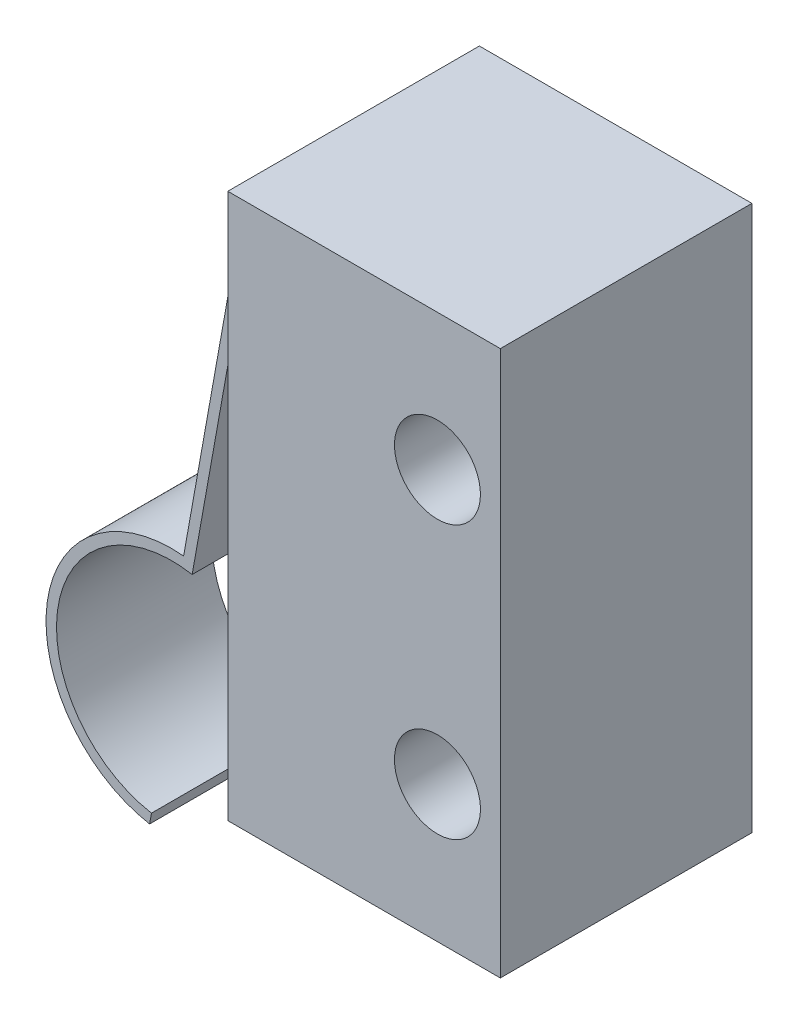
ISO-10303-21;
HEADER;
FILE_DESCRIPTION(('STEP AP214'),'2;1');
FILE_NAME('part.step','',(''),(''),'','','');
FILE_SCHEMA(('AUTOMOTIVE_DESIGN { 1 0 10303 214 1 1 1 1 }'));
ENDSEC;
DATA;
#1=APPLICATION_CONTEXT('core data for automotive mechanical design processes');
#2=APPLICATION_PROTOCOL_DEFINITION('international standard','automotive_design',2000,#1);
#3=PRODUCT_CONTEXT('',#1,'mechanical');
#4=PRODUCT('Part','Part','',(#3));
#5=PRODUCT_RELATED_PRODUCT_CATEGORY('part','',(#4));
#6=PRODUCT_DEFINITION_FORMATION('','',#4);
#7=PRODUCT_DEFINITION_CONTEXT('part definition',#1,'design');
#8=PRODUCT_DEFINITION('design','',#6,#7);
#9=PRODUCT_DEFINITION_SHAPE('','',#8);
#10=(LENGTH_UNIT() NAMED_UNIT(*) SI_UNIT(.MILLI.,.METRE.));
#11=(NAMED_UNIT(*) PLANE_ANGLE_UNIT() SI_UNIT($,.RADIAN.));
#12=(NAMED_UNIT(*) SI_UNIT($,.STERADIAN.) SOLID_ANGLE_UNIT());
#13=UNCERTAINTY_MEASURE_WITH_UNIT(LENGTH_MEASURE(1.E-05),#10,'distance_accuracy_value','');
#14=(GEOMETRIC_REPRESENTATION_CONTEXT(3) GLOBAL_UNCERTAINTY_ASSIGNED_CONTEXT((#13)) GLOBAL_UNIT_ASSIGNED_CONTEXT((#10,
#11,#12)) REPRESENTATION_CONTEXT('',''));
#15=CARTESIAN_POINT('',(0.,0.,0.));
#16=DIRECTION('',(0.,0.,1.));
#17=DIRECTION('',(1.,0.,0.));
#18=AXIS2_PLACEMENT_3D('',#15,#16,#17);
#19=CARTESIAN_POINT('',(3.25,6.5,3.));
#20=DIRECTION('',(-1.,0.,0.));
#21=DIRECTION('',(0.,-1.,0.));
#22=AXIS2_PLACEMENT_3D('',#19,#20,#21);
#23=PLANE('',#22);
#24=DIRECTION('',(0.,1.,0.));
#25=VECTOR('',#24,1.);
#26=CARTESIAN_POINT('',(3.25,6.5,-3.));
#27=LINE('',#26,#25);
#28=CARTESIAN_POINT('',(3.25,-6.5,-3.));
#29=VERTEX_POINT('',#28);
#30=CARTESIAN_POINT('',(3.25,6.5,-3.));
#31=VERTEX_POINT('',#30);
#32=EDGE_CURVE('E200',#29,#31,#27,.T.);
#33=ORIENTED_EDGE('',*,*,#32,.T.);
#34=DIRECTION('',(0.,0.,-1.));
#35=VECTOR('',#34,1.);
#36=CARTESIAN_POINT('',(3.25,6.5,3.));
#37=LINE('',#36,#35);
#38=CARTESIAN_POINT('',(3.25,6.5,3.));
#39=VERTEX_POINT('',#38);
#40=EDGE_CURVE('E11',#39,#31,#37,.T.);
#41=ORIENTED_EDGE('',*,*,#40,.F.);
#42=DIRECTION('',(0.,1.,0.));
#43=VECTOR('',#42,1.);
#44=CARTESIAN_POINT('',(3.25,6.5,3.));
#45=LINE('',#44,#43);
#46=CARTESIAN_POINT('',(3.25,-6.5,3.));
#47=VERTEX_POINT('',#46);
#48=EDGE_CURVE('E203',#47,#39,#45,.T.);
#49=ORIENTED_EDGE('',*,*,#48,.F.);
#50=DIRECTION('',(0.,0.,-1.));
#51=VECTOR('',#50,1.);
#52=CARTESIAN_POINT('',(3.25,-6.5,3.));
#53=LINE('',#52,#51);
#54=EDGE_CURVE('E213',#47,#29,#53,.T.);
#55=ORIENTED_EDGE('',*,*,#54,.T.);
#56=EDGE_LOOP('',(#33,#41,#49,#55));
#57=FACE_BOUND('',#56,.T.);
#58=ADVANCED_FACE('F33',(#57),#23,.F.);
#59=CARTESIAN_POINT('',(-3.25,6.5,3.));
#60=DIRECTION('',(0.,-1.,0.));
#61=DIRECTION('',(0.,0.,-1.));
#62=AXIS2_PLACEMENT_3D('',#59,#60,#61);
#63=PLANE('',#62);
#64=DIRECTION('',(-1.,0.,0.));
#65=VECTOR('',#64,1.);
#66=CARTESIAN_POINT('',(-3.25,6.5,-3.));
#67=LINE('',#66,#65);
#68=CARTESIAN_POINT('',(-3.25,6.5,-3.));
#69=VERTEX_POINT('',#68);
#70=EDGE_CURVE('E216',#31,#69,#67,.T.);
#71=ORIENTED_EDGE('',*,*,#70,.T.);
#72=DIRECTION('',(0.,0.,-1.));
#73=VECTOR('',#72,1.);
#74=CARTESIAN_POINT('',(-3.25,6.5,3.));
#75=LINE('',#74,#73);
#76=CARTESIAN_POINT('',(-3.25,6.5,3.));
#77=VERTEX_POINT('',#76);
#78=EDGE_CURVE('E40',#77,#69,#75,.T.);
#79=ORIENTED_EDGE('',*,*,#78,.F.);
#80=DIRECTION('',(-1.,0.,0.));
#81=VECTOR('',#80,1.);
#82=CARTESIAN_POINT('',(-3.25,6.5,3.));
#83=LINE('',#82,#81);
#84=EDGE_CURVE('E206',#39,#77,#83,.T.);
#85=ORIENTED_EDGE('',*,*,#84,.F.);
#86=ORIENTED_EDGE('',*,*,#40,.T.);
#87=EDGE_LOOP('',(#71,#79,#85,#86));
#88=FACE_BOUND('',#87,.T.);
#89=ADVANCED_FACE('F246',(#88),#63,.F.);
#90=CARTESIAN_POINT('',(-3.25,6.5,3.));
#91=DIRECTION('',(1.,0.,0.));
#92=DIRECTION('',(0.,0.,-1.));
#93=AXIS2_PLACEMENT_3D('',#90,#91,#92);
#94=PLANE('',#93);
#95=DIRECTION('',(0.,0.,-1.));
#96=VECTOR('',#95,1.);
#97=CARTESIAN_POINT('',(-3.25,5.625,1.85));
#98=LINE('',#97,#96);
#99=CARTESIAN_POINT('',(-3.25,5.625,1.85));
#100=VERTEX_POINT('',#99);
#101=CARTESIAN_POINT('',(-3.25,5.625,-1.85));
#102=VERTEX_POINT('',#101);
#103=EDGE_CURVE('E52',#100,#102,#98,.T.);
#104=ORIENTED_EDGE('',*,*,#103,.F.);
#105=DIRECTION('',(0.,-1.,0.));
#106=VECTOR('',#105,1.);
#107=CARTESIAN_POINT('',(-3.25,5.625,1.85));
#108=LINE('',#107,#106);
#109=CARTESIAN_POINT('',(-3.25,5.375,1.85));
#110=VERTEX_POINT('',#109);
#111=EDGE_CURVE('E47',#100,#110,#108,.T.);
#112=ORIENTED_EDGE('',*,*,#111,.T.);
#113=DIRECTION('',(0.,0.,-1.));
#114=VECTOR('',#113,1.);
#115=CARTESIAN_POINT('',(-3.25,5.375,1.85));
#116=LINE('',#115,#114);
#117=CARTESIAN_POINT('',(-3.25,5.375,-1.85));
#118=VERTEX_POINT('',#117);
#119=EDGE_CURVE('E184',#110,#118,#116,.T.);
#120=ORIENTED_EDGE('',*,*,#119,.T.);
#121=DIRECTION('',(0.,-1.,0.));
#122=VECTOR('',#121,1.);
#123=CARTESIAN_POINT('',(-3.25,5.625,-1.85));
#124=LINE('',#123,#122);
#125=EDGE_CURVE('E173',#102,#118,#124,.T.);
#126=ORIENTED_EDGE('',*,*,#125,.F.);
#127=EDGE_LOOP('',(#104,#112,#120,#126));
#128=FACE_BOUND('',#127,.T.);
#129=DIRECTION('',(0.,-1.,0.));
#130=VECTOR('',#129,1.);
#131=CARTESIAN_POINT('',(-3.25,6.5,-3.));
#132=LINE('',#131,#130);
#133=CARTESIAN_POINT('',(-3.25,-6.5,-3.));
#134=VERTEX_POINT('',#133);
#135=EDGE_CURVE('E218',#69,#134,#132,.T.);
#136=ORIENTED_EDGE('',*,*,#135,.T.);
#137=DIRECTION('',(0.,0.,-1.));
#138=VECTOR('',#137,1.);
#139=CARTESIAN_POINT('',(-3.25,-6.5,3.));
#140=LINE('',#139,#138);
#141=CARTESIAN_POINT('',(-3.25,-6.5,3.));
#142=VERTEX_POINT('',#141);
#143=EDGE_CURVE('E223',#142,#134,#140,.T.);
#144=ORIENTED_EDGE('',*,*,#143,.F.);
#145=DIRECTION('',(0.,-1.,0.));
#146=VECTOR('',#145,1.);
#147=CARTESIAN_POINT('',(-3.25,6.5,3.));
#148=LINE('',#147,#146);
#149=EDGE_CURVE('E209',#77,#142,#148,.T.);
#150=ORIENTED_EDGE('',*,*,#149,.F.);
#151=ORIENTED_EDGE('',*,*,#78,.T.);
#152=EDGE_LOOP('',(#136,#144,#150,#151));
#153=FACE_BOUND('',#152,.T.);
#154=ADVANCED_FACE('F230',(#128,#153),#94,.F.);
#155=CARTESIAN_POINT('',(-3.25,-6.5,3.));
#156=DIRECTION('',(0.,1.,0.));
#157=DIRECTION('',(0.,0.,1.));
#158=AXIS2_PLACEMENT_3D('',#155,#156,#157);
#159=PLANE('',#158);
#160=DIRECTION('',(1.,0.,0.));
#161=VECTOR('',#160,1.);
#162=CARTESIAN_POINT('',(-3.25,-6.5,-3.));
#163=LINE('',#162,#161);
#164=EDGE_CURVE('E207',#134,#29,#163,.T.);
#165=ORIENTED_EDGE('',*,*,#164,.T.);
#166=ORIENTED_EDGE('',*,*,#54,.F.);
#167=DIRECTION('',(1.,0.,0.));
#168=VECTOR('',#167,1.);
#169=CARTESIAN_POINT('',(-3.25,-6.5,3.));
#170=LINE('',#169,#168);
#171=EDGE_CURVE('E211',#142,#47,#170,.T.);
#172=ORIENTED_EDGE('',*,*,#171,.F.);
#173=ORIENTED_EDGE('',*,*,#143,.T.);
#174=EDGE_LOOP('',(#165,#166,#172,#173));
#175=FACE_BOUND('',#174,.T.);
#176=ADVANCED_FACE('F239',(#175),#159,.F.);
#177=CARTESIAN_POINT('',(0.,0.,3.));
#178=DIRECTION('',(0.,0.,1.));
#179=DIRECTION('',(1.,0.,0.));
#180=AXIS2_PLACEMENT_3D('',#177,#178,#179);
#181=PLANE('',#180);
#182=CARTESIAN_POINT('',(1.74999999999999,-3.25,3.));
#183=DIRECTION('',(0.,0.,1.));
#184=DIRECTION('',(-1.,0.,0.));
#185=AXIS2_PLACEMENT_3D('',#182,#183,#184);
#186=CIRCLE('',#185,1.025);
#187=CARTESIAN_POINT('',(0.724999999999993,-3.25,3.));
#188=VERTEX_POINT('',#187);
#189=EDGE_CURVE('E142',#188,#188,#186,.T.);
#190=ORIENTED_EDGE('',*,*,#189,.F.);
#191=EDGE_LOOP('',(#190));
#192=FACE_BOUND('',#191,.T.);
#193=CARTESIAN_POINT('',(1.74999999999999,3.25,3.));
#194=DIRECTION('',(0.,0.,1.));
#195=DIRECTION('',(1.,0.,0.));
#196=AXIS2_PLACEMENT_3D('',#193,#194,#195);
#197=CIRCLE('',#196,1.025);
#198=CARTESIAN_POINT('',(2.77499999999999,3.25,3.));
#199=VERTEX_POINT('',#198);
#200=EDGE_CURVE('E194',#199,#199,#197,.T.);
#201=ORIENTED_EDGE('',*,*,#200,.F.);
#202=EDGE_LOOP('',(#201));
#203=FACE_BOUND('',#202,.T.);
#204=ORIENTED_EDGE('',*,*,#48,.T.);
#205=ORIENTED_EDGE('',*,*,#84,.T.);
#206=ORIENTED_EDGE('',*,*,#149,.T.);
#207=ORIENTED_EDGE('',*,*,#171,.T.);
#208=EDGE_LOOP('',(#204,#205,#206,#207));
#209=FACE_BOUND('',#208,.T.);
#210=ADVANCED_FACE('F245',(#192,#203,#209),#181,.T.);
#211=CARTESIAN_POINT('',(0.,0.,-3.));
#212=DIRECTION('',(0.,0.,1.));
#213=DIRECTION('',(1.,0.,0.));
#214=AXIS2_PLACEMENT_3D('',#211,#212,#213);
#215=PLANE('',#214);
#216=CARTESIAN_POINT('',(1.74999999999999,-3.25,-3.));
#217=DIRECTION('',(0.,0.,1.));
#218=DIRECTION('',(-1.,0.,0.));
#219=AXIS2_PLACEMENT_3D('',#216,#217,#218);
#220=CIRCLE('',#219,1.025);
#221=CARTESIAN_POINT('',(0.724999999999993,-3.25,-3.));
#222=VERTEX_POINT('',#221);
#223=EDGE_CURVE('E191',#222,#222,#220,.T.);
#224=ORIENTED_EDGE('',*,*,#223,.T.);
#225=EDGE_LOOP('',(#224));
#226=FACE_BOUND('',#225,.T.);
#227=CARTESIAN_POINT('',(1.74999999999999,3.25,-3.));
#228=DIRECTION('',(0.,0.,1.));
#229=DIRECTION('',(1.,0.,0.));
#230=AXIS2_PLACEMENT_3D('',#227,#228,#229);
#231=CIRCLE('',#230,1.025);
#232=CARTESIAN_POINT('',(2.77499999999999,3.25,-3.));
#233=VERTEX_POINT('',#232);
#234=EDGE_CURVE('E197',#233,#233,#231,.T.);
#235=ORIENTED_EDGE('',*,*,#234,.T.);
#236=EDGE_LOOP('',(#235));
#237=FACE_BOUND('',#236,.T.);
#238=ORIENTED_EDGE('',*,*,#32,.F.);
#239=ORIENTED_EDGE('',*,*,#164,.F.);
#240=ORIENTED_EDGE('',*,*,#135,.F.);
#241=ORIENTED_EDGE('',*,*,#70,.F.);
#242=EDGE_LOOP('',(#238,#239,#240,#241));
#243=FACE_BOUND('',#242,.T.);
#244=ADVANCED_FACE('F236',(#226,#237,#243),#215,.F.);
#245=CARTESIAN_POINT('',(1.74999999999999,3.25,-3.));
#246=DIRECTION('',(0.,0.,1.));
#247=DIRECTION('',(1.,0.,0.));
#248=AXIS2_PLACEMENT_3D('',#245,#246,#247);
#249=CYLINDRICAL_SURFACE('',#248,1.025);
#250=ORIENTED_EDGE('',*,*,#234,.F.);
#251=EDGE_LOOP('',(#250));
#252=FACE_BOUND('',#251,.T.);
#253=ORIENTED_EDGE('',*,*,#200,.T.);
#254=EDGE_LOOP('',(#253));
#255=FACE_BOUND('',#254,.T.);
#256=ADVANCED_FACE('F258',(#252,#255),#249,.F.);
#257=CARTESIAN_POINT('',(1.74999999999999,-3.25,-3.));
#258=DIRECTION('',(0.,0.,1.));
#259=DIRECTION('',(1.,0.,0.));
#260=AXIS2_PLACEMENT_3D('',#257,#258,#259);
#261=CYLINDRICAL_SURFACE('',#260,1.025);
#262=ORIENTED_EDGE('',*,*,#223,.F.);
#263=EDGE_LOOP('',(#262));
#264=FACE_BOUND('',#263,.T.);
#265=ORIENTED_EDGE('',*,*,#189,.T.);
#266=EDGE_LOOP('',(#265));
#267=FACE_BOUND('',#266,.T.);
#268=ADVANCED_FACE('F265',(#264,#267),#261,.F.);
#269=CARTESIAN_POINT('',(-5.73529411764706,-5.69844152765688,1.85));
#270=DIRECTION('',(0.,0.,-1.));
#271=DIRECTION('',(-1.,0.,0.));
#272=AXIS2_PLACEMENT_3D('',#269,#270,#271);
#273=CYLINDRICAL_SURFACE('',#272,3.);
#274=CARTESIAN_POINT('',(-5.73529411764706,-5.69844152765688,-1.85));
#275=DIRECTION('',(0.,0.,1.));
#276=DIRECTION('',(1.,0.,0.));
#277=AXIS2_PLACEMENT_3D('',#274,#275,#276);
#278=CIRCLE('',#277,3.);
#279=CARTESIAN_POINT('',(-5.4538002691379,-2.71167718923788,-1.85));
#280=VERTEX_POINT('',#279);
#281=CARTESIAN_POINT('',(-6.26470588235294,-8.65135926836538,-1.85));
#282=VERTEX_POINT('',#281);
#283=EDGE_CURVE('E138',#280,#282,#278,.T.);
#284=ORIENTED_EDGE('',*,*,#283,.T.);
#285=DIRECTION('',(0.,0.,-1.));
#286=VECTOR('',#285,1.);
#287=CARTESIAN_POINT('',(-6.26470588235294,-8.65135926836538,1.85));
#288=LINE('',#287,#286);
#289=CARTESIAN_POINT('',(-6.26470588235294,-8.65135926836538,1.85));
#290=VERTEX_POINT('',#289);
#291=EDGE_CURVE('E135',#290,#282,#288,.T.);
#292=ORIENTED_EDGE('',*,*,#291,.F.);
#293=CARTESIAN_POINT('',(-5.73529411764706,-5.69844152765688,1.85));
#294=DIRECTION('',(0.,0.,1.));
#295=DIRECTION('',(1.,0.,0.));
#296=AXIS2_PLACEMENT_3D('',#293,#294,#295);
#297=CIRCLE('',#296,3.);
#298=CARTESIAN_POINT('',(-5.4538002691379,-2.71167718923788,1.85));
#299=VERTEX_POINT('',#298);
#300=EDGE_CURVE('E120',#299,#290,#297,.T.);
#301=ORIENTED_EDGE('',*,*,#300,.F.);
#302=DIRECTION('',(0.,0.,-1.));
#303=VECTOR('',#302,1.);
#304=CARTESIAN_POINT('',(-5.4538002691379,-2.71167718923788,1.85));
#305=LINE('',#304,#303);
#306=EDGE_CURVE('E160',#299,#280,#305,.T.);
#307=ORIENTED_EDGE('',*,*,#306,.T.);
#308=EDGE_LOOP('',(#284,#292,#301,#307));
#309=FACE_BOUND('',#308,.T.);
#310=ADVANCED_FACE('F136',(#309),#273,.T.);
#311=CARTESIAN_POINT('',(-6.22058823529412,-8.40528278997301,1.85));
#312=DIRECTION('',(0.9843059135695,-0.176470588235295,0.));
#313=DIRECTION('',(0.176470588235295,0.984305913569501,0.));
#314=AXIS2_PLACEMENT_3D('',#311,#312,#313);
#315=PLANE('',#314);
#316=DIRECTION('',(-0.176470588235295,-0.9843059135695,0.));
#317=VECTOR('',#316,1.);
#318=CARTESIAN_POINT('',(-6.22058823529412,-8.40528278997301,-1.85));
#319=LINE('',#318,#317);
#320=CARTESIAN_POINT('',(-6.22058823529412,-8.40528278997301,-1.85));
#321=VERTEX_POINT('',#320);
#322=EDGE_CURVE('E162',#321,#282,#319,.T.);
#323=ORIENTED_EDGE('',*,*,#322,.F.);
#324=DIRECTION('',(0.,0.,-1.));
#325=VECTOR('',#324,1.);
#326=CARTESIAN_POINT('',(-6.22058823529412,-8.40528278997301,1.85));
#327=LINE('',#326,#325);
#328=CARTESIAN_POINT('',(-6.22058823529412,-8.40528278997301,1.85));
#329=VERTEX_POINT('',#328);
#330=EDGE_CURVE('E143',#329,#321,#327,.T.);
#331=ORIENTED_EDGE('',*,*,#330,.F.);
#332=DIRECTION('',(-0.176470588235295,-0.9843059135695,0.));
#333=VECTOR('',#332,1.);
#334=CARTESIAN_POINT('',(-6.22058823529412,-8.40528278997301,1.85));
#335=LINE('',#334,#333);
#336=EDGE_CURVE('E125',#329,#290,#335,.T.);
#337=ORIENTED_EDGE('',*,*,#336,.T.);
#338=ORIENTED_EDGE('',*,*,#291,.T.);
#339=EDGE_LOOP('',(#323,#331,#337,#338));
#340=FACE_BOUND('',#339,.T.);
#341=ADVANCED_FACE('F145',(#340),#315,.T.);
#342=CARTESIAN_POINT('',(-5.73529411764706,-5.69844152765688,1.85));
#343=DIRECTION('',(0.,0.,-1.));
#344=DIRECTION('',(-1.,0.,0.));
#345=AXIS2_PLACEMENT_3D('',#342,#343,#344);
#346=CYLINDRICAL_SURFACE('',#345,2.75);
#347=CARTESIAN_POINT('',(-5.73529411764706,-5.69844152765688,-1.85));
#348=DIRECTION('',(0.,0.,1.));
#349=DIRECTION('',(1.,0.,0.));
#350=AXIS2_PLACEMENT_3D('',#347,#348,#349);
#351=CIRCLE('',#350,2.75);
#352=CARTESIAN_POINT('',(-5.25,-2.99160026534076,-1.85));
#353=VERTEX_POINT('',#352);
#354=EDGE_CURVE('E164',#353,#321,#351,.T.);
#355=ORIENTED_EDGE('',*,*,#354,.F.);
#356=DIRECTION('',(0.,0.,-1.));
#357=VECTOR('',#356,1.);
#358=CARTESIAN_POINT('',(-5.25,-2.99160026534076,1.85));
#359=LINE('',#358,#357);
#360=CARTESIAN_POINT('',(-5.25,-2.99160026534076,1.85));
#361=VERTEX_POINT('',#360);
#362=EDGE_CURVE('E188',#361,#353,#359,.T.);
#363=ORIENTED_EDGE('',*,*,#362,.F.);
#364=CARTESIAN_POINT('',(-5.73529411764706,-5.69844152765688,1.85));
#365=DIRECTION('',(0.,0.,1.));
#366=DIRECTION('',(1.,0.,0.));
#367=AXIS2_PLACEMENT_3D('',#364,#365,#366);
#368=CIRCLE('',#367,2.75);
#369=EDGE_CURVE('E146',#361,#329,#368,.T.);
#370=ORIENTED_EDGE('',*,*,#369,.T.);
#371=ORIENTED_EDGE('',*,*,#330,.T.);
#372=EDGE_LOOP('',(#355,#363,#370,#371));
#373=FACE_BOUND('',#372,.T.);
#374=ADVANCED_FACE('F274',(#373),#346,.F.);
#375=CARTESIAN_POINT('',(-3.75,5.375,1.85));
#376=DIRECTION('',(0.984305913569501,-0.176470588235294,0.));
#377=DIRECTION('',(0.176470588235294,0.984305913569501,0.));
#378=AXIS2_PLACEMENT_3D('',#375,#376,#377);
#379=PLANE('',#378);
#380=DIRECTION('',(-0.176470588235294,-0.984305913569501,0.));
#381=VECTOR('',#380,1.);
#382=CARTESIAN_POINT('',(-3.75,5.375,-1.85));
#383=LINE('',#382,#381);
#384=CARTESIAN_POINT('',(-3.75,5.375,-1.85));
#385=VERTEX_POINT('',#384);
#386=EDGE_CURVE('E167',#385,#353,#383,.T.);
#387=ORIENTED_EDGE('',*,*,#386,.F.);
#388=DIRECTION('',(0.,0.,-1.));
#389=VECTOR('',#388,1.);
#390=CARTESIAN_POINT('',(-3.75,5.375,1.85));
#391=LINE('',#390,#389);
#392=CARTESIAN_POINT('',(-3.75,5.375,1.85));
#393=VERTEX_POINT('',#392);
#394=EDGE_CURVE('E186',#393,#385,#391,.T.);
#395=ORIENTED_EDGE('',*,*,#394,.F.);
#396=DIRECTION('',(-0.176470588235294,-0.984305913569501,0.));
#397=VECTOR('',#396,1.);
#398=CARTESIAN_POINT('',(-3.75,5.375,1.85));
#399=LINE('',#398,#397);
#400=EDGE_CURVE('E148',#393,#361,#399,.T.);
#401=ORIENTED_EDGE('',*,*,#400,.T.);
#402=ORIENTED_EDGE('',*,*,#362,.T.);
#403=EDGE_LOOP('',(#387,#395,#401,#402));
#404=FACE_BOUND('',#403,.T.);
#405=ADVANCED_FACE('F277',(#404),#379,.T.);
#406=CARTESIAN_POINT('',(-3.25,5.375,1.85));
#407=DIRECTION('',(0.,-1.,0.));
#408=DIRECTION('',(0.,0.,-1.));
#409=AXIS2_PLACEMENT_3D('',#406,#407,#408);
#410=PLANE('',#409);
#411=DIRECTION('',(-1.,0.,0.));
#412=VECTOR('',#411,1.);
#413=CARTESIAN_POINT('',(-3.25,5.375,-1.85));
#414=LINE('',#413,#412);
#415=EDGE_CURVE('E170',#118,#385,#414,.T.);
#416=ORIENTED_EDGE('',*,*,#415,.F.);
#417=ORIENTED_EDGE('',*,*,#119,.F.);
#418=DIRECTION('',(-1.,0.,0.));
#419=VECTOR('',#418,1.);
#420=CARTESIAN_POINT('',(-3.25,5.375,1.85));
#421=LINE('',#420,#419);
#422=EDGE_CURVE('E153',#110,#393,#421,.T.);
#423=ORIENTED_EDGE('',*,*,#422,.T.);
#424=ORIENTED_EDGE('',*,*,#394,.T.);
#425=EDGE_LOOP('',(#416,#417,#423,#424));
#426=FACE_BOUND('',#425,.T.);
#427=ADVANCED_FACE('F281',(#426),#410,.T.);
#428=CARTESIAN_POINT('',(-3.25,5.625,1.85));
#429=DIRECTION('',(0.,-1.,0.));
#430=DIRECTION('',(0.,0.,-1.));
#431=AXIS2_PLACEMENT_3D('',#428,#429,#430);
#432=PLANE('',#431);
#433=DIRECTION('',(1.,0.,0.));
#434=VECTOR('',#433,1.);
#435=CARTESIAN_POINT('',(-3.25,5.625,-1.85));
#436=LINE('',#435,#434);
#437=CARTESIAN_POINT('',(-3.95916500663352,5.625,-1.85));
#438=VERTEX_POINT('',#437);
#439=EDGE_CURVE('E176',#102,#438,#436,.F.);
#440=ORIENTED_EDGE('',*,*,#439,.T.);
#441=DIRECTION('',(0.,0.,-1.));
#442=VECTOR('',#441,1.);
#443=CARTESIAN_POINT('',(-3.95916500663352,5.625,1.85));
#444=LINE('',#443,#442);
#445=CARTESIAN_POINT('',(-3.95916500663352,5.625,1.85));
#446=VERTEX_POINT('',#445);
#447=EDGE_CURVE('E180',#446,#438,#444,.T.);
#448=ORIENTED_EDGE('',*,*,#447,.F.);
#449=DIRECTION('',(1.,0.,0.));
#450=VECTOR('',#449,1.);
#451=CARTESIAN_POINT('',(-3.25,5.625,1.85));
#452=LINE('',#451,#450);
#453=EDGE_CURVE('E157',#100,#446,#452,.F.);
#454=ORIENTED_EDGE('',*,*,#453,.F.);
#455=ORIENTED_EDGE('',*,*,#103,.T.);
#456=EDGE_LOOP('',(#440,#448,#454,#455));
#457=FACE_BOUND('',#456,.T.);
#458=ADVANCED_FACE('F285',(#457),#432,.F.);
#459=CARTESIAN_POINT('',(-3.99607647839238,5.41911764705883,1.85));
#460=DIRECTION('',(0.984305913569501,-0.176470588235294,0.));
#461=DIRECTION('',(0.176470588235294,0.984305913569501,0.));
#462=AXIS2_PLACEMENT_3D('',#459,#460,#461);
#463=PLANE('',#462);
#464=DIRECTION('',(-0.176470588235294,-0.984305913569501,0.));
#465=VECTOR('',#464,1.);
#466=CARTESIAN_POINT('',(-3.99607647839238,5.41911764705883,-1.85));
#467=LINE('',#466,#465);
#468=EDGE_CURVE('E132',#438,#280,#467,.T.);
#469=ORIENTED_EDGE('',*,*,#468,.T.);
#470=ORIENTED_EDGE('',*,*,#306,.F.);
#471=DIRECTION('',(-0.176470588235294,-0.984305913569501,0.));
#472=VECTOR('',#471,1.);
#473=CARTESIAN_POINT('',(-3.99607647839238,5.41911764705883,1.85));
#474=LINE('',#473,#472);
#475=EDGE_CURVE('E128',#446,#299,#474,.T.);
#476=ORIENTED_EDGE('',*,*,#475,.F.);
#477=ORIENTED_EDGE('',*,*,#447,.T.);
#478=EDGE_LOOP('',(#469,#470,#476,#477));
#479=FACE_BOUND('',#478,.T.);
#480=ADVANCED_FACE('F289',(#479),#463,.F.);
#481=CARTESIAN_POINT('',(-5.73529411764706,-5.69844152765688,1.85));
#482=DIRECTION('',(0.,0.,1.));
#483=DIRECTION('',(1.,0.,0.));
#484=AXIS2_PLACEMENT_3D('',#481,#482,#483);
#485=PLANE('',#484);
#486=ORIENTED_EDGE('',*,*,#300,.T.);
#487=ORIENTED_EDGE('',*,*,#336,.F.);
#488=ORIENTED_EDGE('',*,*,#369,.F.);
#489=ORIENTED_EDGE('',*,*,#400,.F.);
#490=ORIENTED_EDGE('',*,*,#422,.F.);
#491=ORIENTED_EDGE('',*,*,#111,.F.);
#492=ORIENTED_EDGE('',*,*,#453,.T.);
#493=ORIENTED_EDGE('',*,*,#475,.T.);
#494=EDGE_LOOP('',(#486,#487,#488,#489,#490,#491,#492,#493));
#495=FACE_BOUND('',#494,.T.);
#496=ADVANCED_FACE('F122',(#495),#485,.T.);
#497=CARTESIAN_POINT('',(-5.73529411764706,-5.69844152765688,-1.85));
#498=DIRECTION('',(0.,0.,1.));
#499=DIRECTION('',(1.,0.,0.));
#500=AXIS2_PLACEMENT_3D('',#497,#498,#499);
#501=PLANE('',#500);
#502=ORIENTED_EDGE('',*,*,#283,.F.);
#503=ORIENTED_EDGE('',*,*,#468,.F.);
#504=ORIENTED_EDGE('',*,*,#439,.F.);
#505=ORIENTED_EDGE('',*,*,#125,.T.);
#506=ORIENTED_EDGE('',*,*,#415,.T.);
#507=ORIENTED_EDGE('',*,*,#386,.T.);
#508=ORIENTED_EDGE('',*,*,#354,.T.);
#509=ORIENTED_EDGE('',*,*,#322,.T.);
#510=EDGE_LOOP('',(#502,#503,#504,#505,#506,#507,#508,#509));
#511=FACE_BOUND('',#510,.T.);
#512=ADVANCED_FACE('F294',(#511),#501,.F.);
#513=CLOSED_SHELL('',(#58,#89,#154,#176,#210,#244,#256,#268,#310,#341,#374,#405,#427,#458,#480,
#496,#512));
#514=MANIFOLD_SOLID_BREP('B2',#513);
#515=ADVANCED_BREP_SHAPE_REPRESENTATION('',(#18,#514),#14);
#516=SHAPE_DEFINITION_REPRESENTATION(#9,#515);
ENDSEC;
END-ISO-10303-21;
